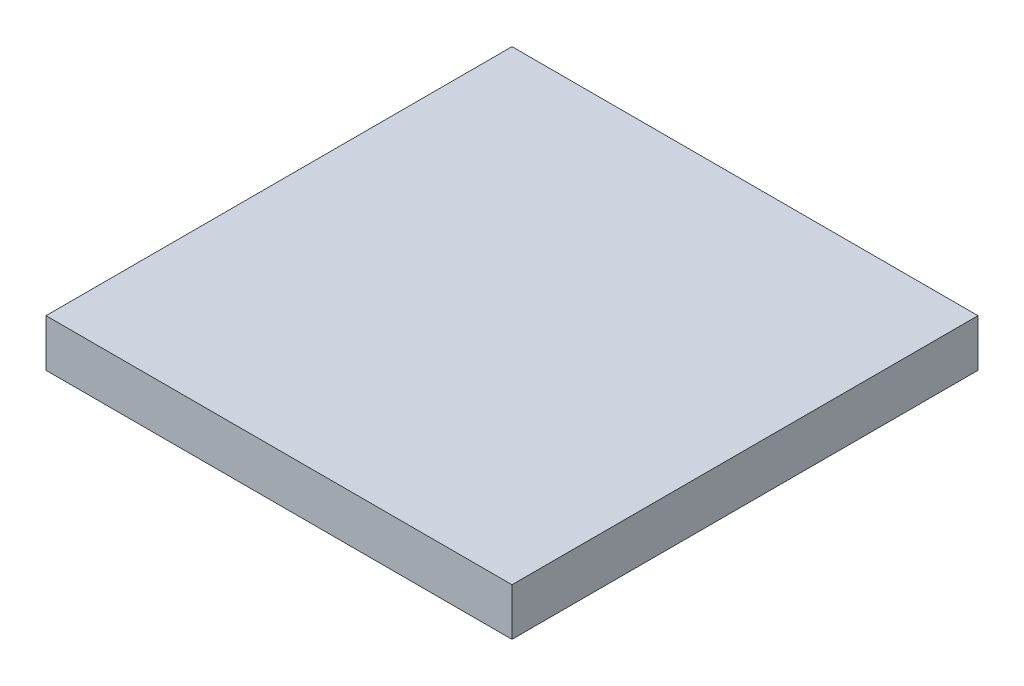
ISO-10303-21;
HEADER;
FILE_DESCRIPTION(('STEP AP214'),'2;1');
FILE_NAME('part.step','',(''),(''),'','','');
FILE_SCHEMA(('AUTOMOTIVE_DESIGN { 1 0 10303 214 1 1 1 1 }'));
ENDSEC;
DATA;
#1=APPLICATION_CONTEXT('core data for automotive mechanical design processes');
#2=APPLICATION_PROTOCOL_DEFINITION('international standard','automotive_design',2000,#1);
#3=PRODUCT_CONTEXT('',#1,'mechanical');
#4=PRODUCT('Part','Part','',(#3));
#5=PRODUCT_RELATED_PRODUCT_CATEGORY('part','',(#4));
#6=PRODUCT_DEFINITION_FORMATION('','',#4);
#7=PRODUCT_DEFINITION_CONTEXT('part definition',#1,'design');
#8=PRODUCT_DEFINITION('design','',#6,#7);
#9=PRODUCT_DEFINITION_SHAPE('','',#8);
#10=(LENGTH_UNIT() NAMED_UNIT(*) SI_UNIT(.MILLI.,.METRE.));
#11=(NAMED_UNIT(*) PLANE_ANGLE_UNIT() SI_UNIT($,.RADIAN.));
#12=(NAMED_UNIT(*) SI_UNIT($,.STERADIAN.) SOLID_ANGLE_UNIT());
#13=UNCERTAINTY_MEASURE_WITH_UNIT(LENGTH_MEASURE(1.E-05),#10,'distance_accuracy_value','');
#14=(GEOMETRIC_REPRESENTATION_CONTEXT(3) GLOBAL_UNCERTAINTY_ASSIGNED_CONTEXT((#13)) GLOBAL_UNIT_ASSIGNED_CONTEXT((#10,
#11,#12)) REPRESENTATION_CONTEXT('',''));
#15=CARTESIAN_POINT('',(0.,0.,0.));
#16=DIRECTION('',(0.,0.,1.));
#17=DIRECTION('',(1.,0.,0.));
#18=AXIS2_PLACEMENT_3D('',#15,#16,#17);
#19=CARTESIAN_POINT('',(16.764,13.97,2.54));
#20=DIRECTION('',(-1.,0.,0.));
#21=DIRECTION('',(0.,0.,1.));
#22=AXIS2_PLACEMENT_3D('',#19,#20,#21);
#23=PLANE('',#22);
#24=DIRECTION('',(0.,0.,-1.));
#25=VECTOR('',#24,1.);
#26=CARTESIAN_POINT('',(16.764,0.,2.54));
#27=LINE('',#26,#25);
#28=CARTESIAN_POINT('',(16.764,0.,2.54));
#29=VERTEX_POINT('',#28);
#30=CARTESIAN_POINT('',(16.764,0.,-2.54));
#31=VERTEX_POINT('',#30);
#32=EDGE_CURVE('E81',#29,#31,#27,.T.);
#33=ORIENTED_EDGE('',*,*,#32,.T.);
#34=DIRECTION('',(0.,-1.,0.));
#35=VECTOR('',#34,1.);
#36=CARTESIAN_POINT('',(16.764,13.97,-2.54));
#37=LINE('',#36,#35);
#38=CARTESIAN_POINT('',(16.764,13.97,-2.54));
#39=VERTEX_POINT('',#38);
#40=EDGE_CURVE('E11',#39,#31,#37,.T.);
#41=ORIENTED_EDGE('',*,*,#40,.F.);
#42=DIRECTION('',(0.,0.,-1.));
#43=VECTOR('',#42,1.);
#44=CARTESIAN_POINT('',(16.764,13.97,2.54));
#45=LINE('',#44,#43);
#46=CARTESIAN_POINT('',(16.764,13.97,2.54));
#47=VERTEX_POINT('',#46);
#48=EDGE_CURVE('E76',#47,#39,#45,.T.);
#49=ORIENTED_EDGE('',*,*,#48,.F.);
#50=DIRECTION('',(0.,-1.,0.));
#51=VECTOR('',#50,1.);
#52=CARTESIAN_POINT('',(16.764,13.97,2.54));
#53=LINE('',#52,#51);
#54=EDGE_CURVE('E72',#47,#29,#53,.T.);
#55=ORIENTED_EDGE('',*,*,#54,.T.);
#56=EDGE_LOOP('',(#33,#41,#49,#55));
#57=FACE_BOUND('',#56,.T.);
#58=ADVANCED_FACE('F32',(#57),#23,.F.);
#59=CARTESIAN_POINT('',(-16.764,13.97,-2.54));
#60=DIRECTION('',(0.,0.,1.));
#61=DIRECTION('',(1.,0.,0.));
#62=AXIS2_PLACEMENT_3D('',#59,#60,#61);
#63=PLANE('',#62);
#64=DIRECTION('',(-1.,0.,0.));
#65=VECTOR('',#64,1.);
#66=CARTESIAN_POINT('',(-16.764,0.,-2.54));
#67=LINE('',#66,#65);
#68=CARTESIAN_POINT('',(-16.764,0.,-2.54));
#69=VERTEX_POINT('',#68);
#70=EDGE_CURVE('E86',#31,#69,#67,.T.);
#71=ORIENTED_EDGE('',*,*,#70,.T.);
#72=DIRECTION('',(0.,-1.,0.));
#73=VECTOR('',#72,1.);
#74=CARTESIAN_POINT('',(-16.764,13.97,-2.54));
#75=LINE('',#74,#73);
#76=CARTESIAN_POINT('',(-16.764,19.05,-2.54));
#77=VERTEX_POINT('',#76);
#78=EDGE_CURVE('E41',#77,#69,#75,.T.);
#79=ORIENTED_EDGE('',*,*,#78,.F.);
#80=DIRECTION('',(-1.,0.,0.));
#81=VECTOR('',#80,1.);
#82=CARTESIAN_POINT('',(-16.764,19.05,-2.54));
#83=LINE('',#82,#81);
#84=CARTESIAN_POINT('',(33.236,19.05,-2.54));
#85=VERTEX_POINT('',#84);
#86=EDGE_CURVE('E135',#85,#77,#83,.T.);
#87=ORIENTED_EDGE('',*,*,#86,.F.);
#88=DIRECTION('',(0.,-1.,0.));
#89=VECTOR('',#88,1.);
#90=CARTESIAN_POINT('',(33.236,19.05,-2.54));
#91=LINE('',#90,#89);
#92=CARTESIAN_POINT('',(33.236,13.97,-2.54));
#93=VERTEX_POINT('',#92);
#94=EDGE_CURVE('E118',#85,#93,#91,.T.);
#95=ORIENTED_EDGE('',*,*,#94,.T.);
#96=DIRECTION('',(-1.,0.,0.));
#97=VECTOR('',#96,1.);
#98=CARTESIAN_POINT('',(-16.764,13.97,-2.54));
#99=LINE('',#98,#97);
#100=EDGE_CURVE('E111',#93,#39,#99,.T.);
#101=ORIENTED_EDGE('',*,*,#100,.T.);
#102=ORIENTED_EDGE('',*,*,#40,.T.);
#103=EDGE_LOOP('',(#71,#79,#87,#95,#101,#102));
#104=FACE_BOUND('',#103,.T.);
#105=ADVANCED_FACE('F115',(#104),#63,.F.);
#106=CARTESIAN_POINT('',(-16.764,13.97,2.54));
#107=DIRECTION('',(1.,0.,0.));
#108=DIRECTION('',(0.,0.,-1.));
#109=AXIS2_PLACEMENT_3D('',#106,#107,#108);
#110=PLANE('',#109);
#111=DIRECTION('',(0.,0.,1.));
#112=VECTOR('',#111,1.);
#113=CARTESIAN_POINT('',(-16.764,0.,2.54));
#114=LINE('',#113,#112);
#115=CARTESIAN_POINT('',(-16.764,0.,2.54));
#116=VERTEX_POINT('',#115);
#117=EDGE_CURVE('E64',#69,#116,#114,.T.);
#118=ORIENTED_EDGE('',*,*,#117,.T.);
#119=DIRECTION('',(0.,-1.,0.));
#120=VECTOR('',#119,1.);
#121=CARTESIAN_POINT('',(-16.764,13.97,2.54));
#122=LINE('',#121,#120);
#123=CARTESIAN_POINT('',(-16.764,13.97,2.54));
#124=VERTEX_POINT('',#123);
#125=EDGE_CURVE('E49',#124,#116,#122,.T.);
#126=ORIENTED_EDGE('',*,*,#125,.F.);
#127=DIRECTION('',(0.,0.,1.));
#128=VECTOR('',#127,1.);
#129=CARTESIAN_POINT('',(-16.764,13.97,-2.54));
#130=LINE('',#129,#128);
#131=CARTESIAN_POINT('',(-16.764,13.97,47.46));
#132=VERTEX_POINT('',#131);
#133=EDGE_CURVE('E129',#124,#132,#130,.T.);
#134=ORIENTED_EDGE('',*,*,#133,.T.);
#135=DIRECTION('',(0.,-1.,0.));
#136=VECTOR('',#135,1.);
#137=CARTESIAN_POINT('',(-16.764,19.05,47.46));
#138=LINE('',#137,#136);
#139=CARTESIAN_POINT('',(-16.764,19.05,47.46));
#140=VERTEX_POINT('',#139);
#141=EDGE_CURVE('E87',#140,#132,#138,.T.);
#142=ORIENTED_EDGE('',*,*,#141,.F.);
#143=DIRECTION('',(0.,0.,1.));
#144=VECTOR('',#143,1.);
#145=CARTESIAN_POINT('',(-16.764,19.05,-2.54));
#146=LINE('',#145,#144);
#147=EDGE_CURVE('E119',#77,#140,#146,.T.);
#148=ORIENTED_EDGE('',*,*,#147,.F.);
#149=ORIENTED_EDGE('',*,*,#78,.T.);
#150=EDGE_LOOP('',(#118,#126,#134,#142,#148,#149));
#151=FACE_BOUND('',#150,.T.);
#152=ADVANCED_FACE('F157',(#151),#110,.F.);
#153=CARTESIAN_POINT('',(-16.764,13.97,2.54));
#154=DIRECTION('',(0.,0.,-1.));
#155=DIRECTION('',(-1.,0.,0.));
#156=AXIS2_PLACEMENT_3D('',#153,#154,#155);
#157=PLANE('',#156);
#158=DIRECTION('',(1.,0.,0.));
#159=VECTOR('',#158,1.);
#160=CARTESIAN_POINT('',(-16.764,0.,2.54));
#161=LINE('',#160,#159);
#162=EDGE_CURVE('E69',#116,#29,#161,.T.);
#163=ORIENTED_EDGE('',*,*,#162,.T.);
#164=ORIENTED_EDGE('',*,*,#54,.F.);
#165=DIRECTION('',(1.,0.,0.));
#166=VECTOR('',#165,1.);
#167=CARTESIAN_POINT('',(-16.764,13.97,2.54));
#168=LINE('',#167,#166);
#169=EDGE_CURVE('E83',#124,#47,#168,.T.);
#170=ORIENTED_EDGE('',*,*,#169,.F.);
#171=ORIENTED_EDGE('',*,*,#125,.T.);
#172=EDGE_LOOP('',(#163,#164,#170,#171));
#173=FACE_BOUND('',#172,.T.);
#174=ADVANCED_FACE('F71',(#173),#157,.F.);
#175=CARTESIAN_POINT('',(0.,0.,0.));
#176=DIRECTION('',(0.,-1.,0.));
#177=DIRECTION('',(0.,0.,-1.));
#178=AXIS2_PLACEMENT_3D('',#175,#176,#177);
#179=PLANE('',#178);
#180=ORIENTED_EDGE('',*,*,#32,.F.);
#181=ORIENTED_EDGE('',*,*,#162,.F.);
#182=ORIENTED_EDGE('',*,*,#117,.F.);
#183=ORIENTED_EDGE('',*,*,#70,.F.);
#184=EDGE_LOOP('',(#180,#181,#182,#183));
#185=FACE_BOUND('',#184,.T.);
#186=ADVANCED_FACE('F85',(#185),#179,.T.);
#187=CARTESIAN_POINT('',(0.,13.97,0.));
#188=DIRECTION('',(0.,1.,0.));
#189=DIRECTION('',(0.,0.,1.));
#190=AXIS2_PLACEMENT_3D('',#187,#188,#189);
#191=PLANE('',#190);
#192=ORIENTED_EDGE('',*,*,#169,.T.);
#193=ORIENTED_EDGE('',*,*,#48,.T.);
#194=ORIENTED_EDGE('',*,*,#100,.F.);
#195=DIRECTION('',(0.,0.,-1.));
#196=VECTOR('',#195,1.);
#197=CARTESIAN_POINT('',(33.236,13.97,-2.54));
#198=LINE('',#197,#196);
#199=CARTESIAN_POINT('',(33.236,13.97,47.46));
#200=VERTEX_POINT('',#199);
#201=EDGE_CURVE('E120',#200,#93,#198,.T.);
#202=ORIENTED_EDGE('',*,*,#201,.F.);
#203=DIRECTION('',(1.,0.,0.));
#204=VECTOR('',#203,1.);
#205=CARTESIAN_POINT('',(-16.764,13.97,47.46));
#206=LINE('',#205,#204);
#207=EDGE_CURVE('E125',#132,#200,#206,.T.);
#208=ORIENTED_EDGE('',*,*,#207,.F.);
#209=ORIENTED_EDGE('',*,*,#133,.F.);
#210=EDGE_LOOP('',(#192,#193,#194,#202,#208,#209));
#211=FACE_BOUND('',#210,.T.);
#212=ADVANCED_FACE('F108',(#211),#191,.F.);
#213=CARTESIAN_POINT('',(-16.764,19.05,47.46));
#214=DIRECTION('',(0.,0.,-1.));
#215=DIRECTION('',(-1.,0.,0.));
#216=AXIS2_PLACEMENT_3D('',#213,#214,#215);
#217=PLANE('',#216);
#218=ORIENTED_EDGE('',*,*,#207,.T.);
#219=DIRECTION('',(0.,-1.,0.));
#220=VECTOR('',#219,1.);
#221=CARTESIAN_POINT('',(33.236,19.05,47.46));
#222=LINE('',#221,#220);
#223=CARTESIAN_POINT('',(33.236,19.05,47.46));
#224=VERTEX_POINT('',#223);
#225=EDGE_CURVE('E91',#224,#200,#222,.T.);
#226=ORIENTED_EDGE('',*,*,#225,.F.);
#227=DIRECTION('',(1.,0.,0.));
#228=VECTOR('',#227,1.);
#229=CARTESIAN_POINT('',(-16.764,19.05,47.46));
#230=LINE('',#229,#228);
#231=EDGE_CURVE('E122',#140,#224,#230,.T.);
#232=ORIENTED_EDGE('',*,*,#231,.F.);
#233=ORIENTED_EDGE('',*,*,#141,.T.);
#234=EDGE_LOOP('',(#218,#226,#232,#233));
#235=FACE_BOUND('',#234,.T.);
#236=ADVANCED_FACE('F153',(#235),#217,.F.);
#237=CARTESIAN_POINT('',(33.236,19.05,-2.54));
#238=DIRECTION('',(-1.,0.,0.));
#239=DIRECTION('',(0.,0.,1.));
#240=AXIS2_PLACEMENT_3D('',#237,#238,#239);
#241=PLANE('',#240);
#242=ORIENTED_EDGE('',*,*,#201,.T.);
#243=ORIENTED_EDGE('',*,*,#94,.F.);
#244=DIRECTION('',(0.,0.,-1.));
#245=VECTOR('',#244,1.);
#246=CARTESIAN_POINT('',(33.236,19.05,-2.54));
#247=LINE('',#246,#245);
#248=EDGE_CURVE('E144',#224,#85,#247,.T.);
#249=ORIENTED_EDGE('',*,*,#248,.F.);
#250=ORIENTED_EDGE('',*,*,#225,.T.);
#251=EDGE_LOOP('',(#242,#243,#249,#250));
#252=FACE_BOUND('',#251,.T.);
#253=ADVANCED_FACE('F141',(#252),#241,.F.);
#254=CARTESIAN_POINT('',(0.,19.05,0.));
#255=DIRECTION('',(0.,1.,0.));
#256=DIRECTION('',(0.,0.,1.));
#257=AXIS2_PLACEMENT_3D('',#254,#255,#256);
#258=PLANE('',#257);
#259=ORIENTED_EDGE('',*,*,#147,.T.);
#260=ORIENTED_EDGE('',*,*,#231,.T.);
#261=ORIENTED_EDGE('',*,*,#248,.T.);
#262=ORIENTED_EDGE('',*,*,#86,.T.);
#263=EDGE_LOOP('',(#259,#260,#261,#262));
#264=FACE_BOUND('',#263,.T.);
#265=ADVANCED_FACE('F168',(#264),#258,.T.);
#266=CLOSED_SHELL('',(#58,#105,#152,#174,#186,#212,#236,#253,#265));
#267=MANIFOLD_SOLID_BREP('B2',#266);
#268=ADVANCED_BREP_SHAPE_REPRESENTATION('',(#18,#267),#14);
#269=SHAPE_DEFINITION_REPRESENTATION(#9,#268);
ENDSEC;
END-ISO-10303-21;
